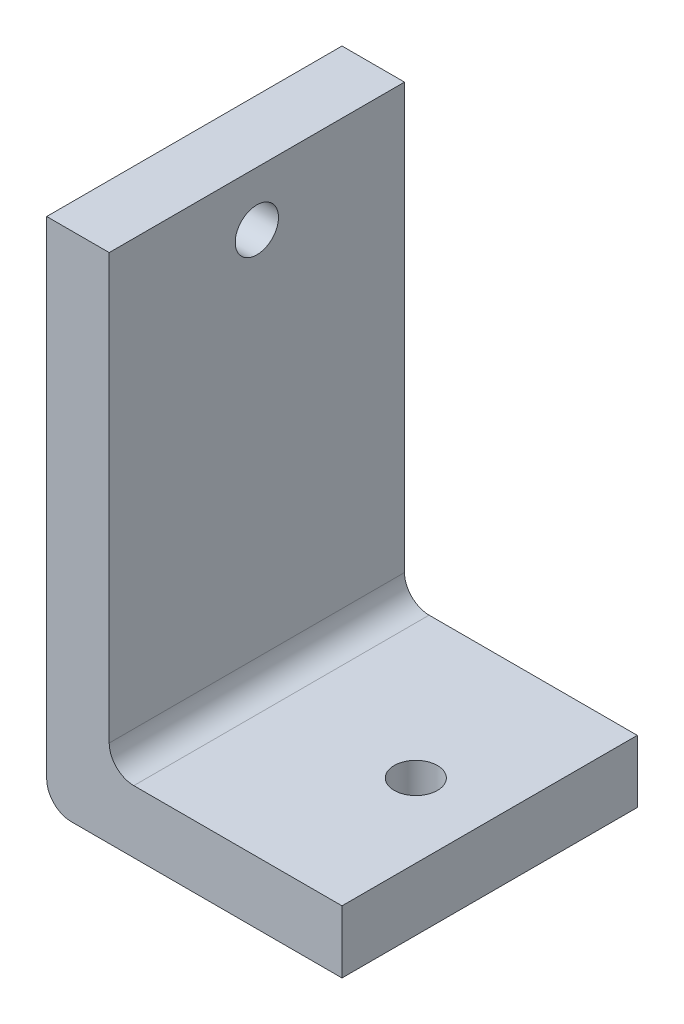
ISO-10303-21;
HEADER;
FILE_DESCRIPTION(('STEP AP214'),'2;1');
FILE_NAME('part.step','',(''),(''),'','','');
FILE_SCHEMA(('AUTOMOTIVE_DESIGN { 1 0 10303 214 1 1 1 1 }'));
ENDSEC;
DATA;
#1=APPLICATION_CONTEXT('core data for automotive mechanical design processes');
#2=APPLICATION_PROTOCOL_DEFINITION('international standard','automotive_design',2000,#1);
#3=PRODUCT_CONTEXT('',#1,'mechanical');
#4=PRODUCT('Part','Part','',(#3));
#5=PRODUCT_RELATED_PRODUCT_CATEGORY('part','',(#4));
#6=PRODUCT_DEFINITION_FORMATION('','',#4);
#7=PRODUCT_DEFINITION_CONTEXT('part definition',#1,'design');
#8=PRODUCT_DEFINITION('design','',#6,#7);
#9=PRODUCT_DEFINITION_SHAPE('','',#8);
#10=(LENGTH_UNIT() NAMED_UNIT(*) SI_UNIT(.MILLI.,.METRE.));
#11=(NAMED_UNIT(*) PLANE_ANGLE_UNIT() SI_UNIT($,.RADIAN.));
#12=(NAMED_UNIT(*) SI_UNIT($,.STERADIAN.) SOLID_ANGLE_UNIT());
#13=UNCERTAINTY_MEASURE_WITH_UNIT(LENGTH_MEASURE(1.E-05),#10,'distance_accuracy_value','');
#14=(GEOMETRIC_REPRESENTATION_CONTEXT(3) GLOBAL_UNCERTAINTY_ASSIGNED_CONTEXT((#13)) GLOBAL_UNIT_ASSIGNED_CONTEXT((#10,
#11,#12)) REPRESENTATION_CONTEXT('',''));
#15=CARTESIAN_POINT('',(0.,0.,0.));
#16=DIRECTION('',(0.,0.,1.));
#17=DIRECTION('',(1.,0.,0.));
#18=AXIS2_PLACEMENT_3D('',#15,#16,#17);
#19=CARTESIAN_POINT('',(6.35,0.,-240.));
#20=DIRECTION('',(1.,0.,0.));
#21=DIRECTION('',(0.,0.,-1.));
#22=AXIS2_PLACEMENT_3D('',#19,#20,#21);
#23=PLANE('',#22);
#24=CARTESIAN_POINT('',(6.35,46.5,-225.));
#25=DIRECTION('',(1.,0.,0.));
#26=DIRECTION('',(0.,0.,-1.));
#27=AXIS2_PLACEMENT_3D('',#24,#25,#26);
#28=CIRCLE('',#27,2.19709999999999);
#29=CARTESIAN_POINT('',(6.35,46.5,-227.1971));
#30=VERTEX_POINT('',#29);
#31=EDGE_CURVE('E124',#30,#30,#28,.T.);
#32=ORIENTED_EDGE('',*,*,#31,.F.);
#33=EDGE_LOOP('',(#32));
#34=FACE_BOUND('',#33,.T.);
#35=DIRECTION('',(0.,1.,0.));
#36=VECTOR('',#35,1.);
#37=CARTESIAN_POINT('',(6.35,67.,-210.));
#38=LINE('',#37,#36);
#39=CARTESIAN_POINT('',(6.35,8.85,-210.));
#40=VERTEX_POINT('',#39);
#41=CARTESIAN_POINT('',(6.35,52.,-210.));
#42=VERTEX_POINT('',#41);
#43=EDGE_CURVE('E169',#40,#42,#38,.T.);
#44=ORIENTED_EDGE('',*,*,#43,.F.);
#45=DIRECTION('',(0.,0.,1.));
#46=VECTOR('',#45,1.);
#47=CARTESIAN_POINT('',(6.35,8.85,-240.));
#48=LINE('',#47,#46);
#49=CARTESIAN_POINT('',(6.35,8.85,-240.));
#50=VERTEX_POINT('',#49);
#51=EDGE_CURVE('E69',#40,#50,#48,.F.);
#52=ORIENTED_EDGE('',*,*,#51,.T.);
#53=DIRECTION('',(0.,1.,0.));
#54=VECTOR('',#53,1.);
#55=CARTESIAN_POINT('',(6.35,0.,-240.));
#56=LINE('',#55,#54);
#57=CARTESIAN_POINT('',(6.35,52.,-240.));
#58=VERTEX_POINT('',#57);
#59=EDGE_CURVE('E141',#50,#58,#56,.T.);
#60=ORIENTED_EDGE('',*,*,#59,.T.);
#61=DIRECTION('',(0.,0.,-1.));
#62=VECTOR('',#61,1.);
#63=CARTESIAN_POINT('',(6.35,52.,5.));
#64=LINE('',#63,#62);
#65=EDGE_CURVE('E174',#42,#58,#64,.T.);
#66=ORIENTED_EDGE('',*,*,#65,.F.);
#67=EDGE_LOOP('',(#44,#52,#60,#66));
#68=FACE_BOUND('',#67,.T.);
#69=ADVANCED_FACE('F48',(#34,#68),#23,.T.);
#70=CARTESIAN_POINT('',(0.,6.35,-240.));
#71=DIRECTION('',(0.,1.,0.));
#72=DIRECTION('',(0.,0.,1.));
#73=AXIS2_PLACEMENT_3D('',#70,#71,#72);
#74=PLANE('',#73);
#75=CARTESIAN_POINT('',(22.5,6.35,-225.));
#76=DIRECTION('',(0.,1.,0.));
#77=DIRECTION('',(0.,0.,1.));
#78=AXIS2_PLACEMENT_3D('',#75,#76,#77);
#79=CIRCLE('',#78,2.19709999999999);
#80=CARTESIAN_POINT('',(22.5,6.35,-222.8029));
#81=VERTEX_POINT('',#80);
#82=EDGE_CURVE('E238',#81,#81,#79,.T.);
#83=ORIENTED_EDGE('',*,*,#82,.F.);
#84=EDGE_LOOP('',(#83));
#85=FACE_BOUND('',#84,.T.);
#86=DIRECTION('',(1.,0.,0.));
#87=VECTOR('',#86,1.);
#88=CARTESIAN_POINT('',(0.,6.35,-240.));
#89=LINE('',#88,#87);
#90=CARTESIAN_POINT('',(30.,6.35,-240.));
#91=VERTEX_POINT('',#90);
#92=CARTESIAN_POINT('',(8.85,6.35,-240.));
#93=VERTEX_POINT('',#92);
#94=EDGE_CURVE('E152',#91,#93,#89,.F.);
#95=ORIENTED_EDGE('',*,*,#94,.T.);
#96=DIRECTION('',(0.,0.,1.));
#97=VECTOR('',#96,1.);
#98=CARTESIAN_POINT('',(8.85,6.35,-210.));
#99=LINE('',#98,#97);
#100=CARTESIAN_POINT('',(8.85,6.35,-210.));
#101=VERTEX_POINT('',#100);
#102=EDGE_CURVE('E165',#93,#101,#99,.T.);
#103=ORIENTED_EDGE('',*,*,#102,.T.);
#104=DIRECTION('',(1.,0.,0.));
#105=VECTOR('',#104,1.);
#106=CARTESIAN_POINT('',(0.,6.35,-210.));
#107=LINE('',#106,#105);
#108=CARTESIAN_POINT('',(30.,6.35,-210.));
#109=VERTEX_POINT('',#108);
#110=EDGE_CURVE('E125',#101,#109,#107,.T.);
#111=ORIENTED_EDGE('',*,*,#110,.T.);
#112=DIRECTION('',(0.,0.,1.));
#113=VECTOR('',#112,1.);
#114=CARTESIAN_POINT('',(30.,6.35,-245.));
#115=LINE('',#114,#113);
#116=EDGE_CURVE('E132',#91,#109,#115,.T.);
#117=ORIENTED_EDGE('',*,*,#116,.F.);
#118=EDGE_LOOP('',(#95,#103,#111,#117));
#119=FACE_BOUND('',#118,.T.);
#120=ADVANCED_FACE('F179',(#85,#119),#74,.T.);
#121=CARTESIAN_POINT('',(0.,0.,-240.));
#122=DIRECTION('',(0.,1.,0.));
#123=DIRECTION('',(0.,0.,1.));
#124=AXIS2_PLACEMENT_3D('',#121,#122,#123);
#125=PLANE('',#124);
#126=CARTESIAN_POINT('',(22.5,0.,-225.));
#127=DIRECTION('',(0.,1.,0.));
#128=DIRECTION('',(0.,0.,1.));
#129=AXIS2_PLACEMENT_3D('',#126,#127,#128);
#130=CIRCLE('',#129,2.1971);
#131=CARTESIAN_POINT('',(22.5,0.,-222.8029));
#132=VERTEX_POINT('',#131);
#133=EDGE_CURVE('E133',#132,#132,#130,.T.);
#134=ORIENTED_EDGE('',*,*,#133,.T.);
#135=EDGE_LOOP('',(#134));
#136=FACE_BOUND('',#135,.T.);
#137=DIRECTION('',(1.,0.,0.));
#138=VECTOR('',#137,1.);
#139=CARTESIAN_POINT('',(0.,0.,-210.));
#140=LINE('',#139,#138);
#141=CARTESIAN_POINT('',(2.5,0.,-210.));
#142=VERTEX_POINT('',#141);
#143=CARTESIAN_POINT('',(30.,0.,-210.));
#144=VERTEX_POINT('',#143);
#145=EDGE_CURVE('E113',#142,#144,#140,.T.);
#146=ORIENTED_EDGE('',*,*,#145,.F.);
#147=DIRECTION('',(0.,0.,1.));
#148=VECTOR('',#147,1.);
#149=CARTESIAN_POINT('',(2.5,0.,-240.));
#150=LINE('',#149,#148);
#151=CARTESIAN_POINT('',(2.5,0.,-240.));
#152=VERTEX_POINT('',#151);
#153=EDGE_CURVE('E161',#142,#152,#150,.F.);
#154=ORIENTED_EDGE('',*,*,#153,.T.);
#155=DIRECTION('',(-1.,0.,0.));
#156=VECTOR('',#155,1.);
#157=CARTESIAN_POINT('',(0.,0.,-240.));
#158=LINE('',#157,#156);
#159=CARTESIAN_POINT('',(30.,0.,-240.));
#160=VERTEX_POINT('',#159);
#161=EDGE_CURVE('E138',#160,#152,#158,.T.);
#162=ORIENTED_EDGE('',*,*,#161,.F.);
#163=DIRECTION('',(0.,0.,1.));
#164=VECTOR('',#163,1.);
#165=CARTESIAN_POINT('',(30.,0.,-245.));
#166=LINE('',#165,#164);
#167=EDGE_CURVE('E129',#160,#144,#166,.T.);
#168=ORIENTED_EDGE('',*,*,#167,.T.);
#169=EDGE_LOOP('',(#146,#154,#162,#168));
#170=FACE_BOUND('',#169,.T.);
#171=ADVANCED_FACE('F136',(#136,#170),#125,.F.);
#172=CARTESIAN_POINT('',(0.,0.,-240.));
#173=DIRECTION('',(1.,0.,0.));
#174=DIRECTION('',(0.,0.,-1.));
#175=AXIS2_PLACEMENT_3D('',#172,#173,#174);
#176=PLANE('',#175);
#177=CARTESIAN_POINT('',(0.,46.5,-225.));
#178=DIRECTION('',(1.,0.,0.));
#179=DIRECTION('',(0.,0.,-1.));
#180=AXIS2_PLACEMENT_3D('',#177,#178,#179);
#181=CIRCLE('',#180,2.1971);
#182=CARTESIAN_POINT('',(0.,46.5,-227.1971));
#183=VERTEX_POINT('',#182);
#184=EDGE_CURVE('E176',#183,#183,#181,.T.);
#185=ORIENTED_EDGE('',*,*,#184,.T.);
#186=EDGE_LOOP('',(#185));
#187=FACE_BOUND('',#186,.T.);
#188=DIRECTION('',(0.,1.,0.));
#189=VECTOR('',#188,1.);
#190=CARTESIAN_POINT('',(0.,0.,-240.));
#191=LINE('',#190,#189);
#192=CARTESIAN_POINT('',(0.,2.5,-240.));
#193=VERTEX_POINT('',#192);
#194=CARTESIAN_POINT('',(0.,52.,-240.));
#195=VERTEX_POINT('',#194);
#196=EDGE_CURVE('E149',#193,#195,#191,.T.);
#197=ORIENTED_EDGE('',*,*,#196,.F.);
#198=DIRECTION('',(0.,0.,1.));
#199=VECTOR('',#198,1.);
#200=CARTESIAN_POINT('',(0.,2.5,-240.));
#201=LINE('',#200,#199);
#202=CARTESIAN_POINT('',(0.,2.5,-210.));
#203=VERTEX_POINT('',#202);
#204=EDGE_CURVE('E157',#193,#203,#201,.T.);
#205=ORIENTED_EDGE('',*,*,#204,.T.);
#206=DIRECTION('',(0.,1.,0.));
#207=VECTOR('',#206,1.);
#208=CARTESIAN_POINT('',(0.,67.,-210.));
#209=LINE('',#208,#207);
#210=CARTESIAN_POINT('',(0.,52.,-210.));
#211=VERTEX_POINT('',#210);
#212=EDGE_CURVE('E175',#203,#211,#209,.T.);
#213=ORIENTED_EDGE('',*,*,#212,.T.);
#214=DIRECTION('',(0.,0.,-1.));
#215=VECTOR('',#214,1.);
#216=CARTESIAN_POINT('',(0.,52.,5.));
#217=LINE('',#216,#215);
#218=EDGE_CURVE('E191',#211,#195,#217,.T.);
#219=ORIENTED_EDGE('',*,*,#218,.T.);
#220=EDGE_LOOP('',(#197,#205,#213,#219));
#221=FACE_BOUND('',#220,.T.);
#222=ADVANCED_FACE('F187',(#187,#221),#176,.F.);
#223=CARTESIAN_POINT('',(30.,0.,-245.));
#224=DIRECTION('',(-1.,0.,0.));
#225=DIRECTION('',(0.,0.,1.));
#226=AXIS2_PLACEMENT_3D('',#223,#224,#225);
#227=PLANE('',#226);
#228=DIRECTION('',(0.,1.,0.));
#229=VECTOR('',#228,1.);
#230=CARTESIAN_POINT('',(30.,62.,-210.));
#231=LINE('',#230,#229);
#232=EDGE_CURVE('E118',#144,#109,#231,.T.);
#233=ORIENTED_EDGE('',*,*,#232,.F.);
#234=ORIENTED_EDGE('',*,*,#167,.F.);
#235=DIRECTION('',(0.,1.,0.));
#236=VECTOR('',#235,1.);
#237=CARTESIAN_POINT('',(30.,55.,-240.));
#238=LINE('',#237,#236);
#239=EDGE_CURVE('E139',#160,#91,#238,.T.);
#240=ORIENTED_EDGE('',*,*,#239,.T.);
#241=ORIENTED_EDGE('',*,*,#116,.T.);
#242=EDGE_LOOP('',(#233,#234,#240,#241));
#243=FACE_BOUND('',#242,.T.);
#244=ADVANCED_FACE('F128',(#243),#227,.F.);
#245=CARTESIAN_POINT('',(6.35,55.,-240.));
#246=DIRECTION('',(0.,0.,-1.));
#247=DIRECTION('',(-1.,0.,0.));
#248=AXIS2_PLACEMENT_3D('',#245,#246,#247);
#249=PLANE('',#248);
#250=ORIENTED_EDGE('',*,*,#161,.T.);
#251=CARTESIAN_POINT('',(2.5,2.5,-240.));
#252=DIRECTION('',(0.,0.,-1.));
#253=DIRECTION('',(-1.,0.,0.));
#254=AXIS2_PLACEMENT_3D('',#251,#252,#253);
#255=CIRCLE('',#254,2.5);
#256=EDGE_CURVE('E163',#152,#193,#255,.T.);
#257=ORIENTED_EDGE('',*,*,#256,.T.);
#258=ORIENTED_EDGE('',*,*,#196,.T.);
#259=DIRECTION('',(-1.,0.,0.));
#260=VECTOR('',#259,1.);
#261=CARTESIAN_POINT('',(6.35,52.,-240.));
#262=LINE('',#261,#260);
#263=EDGE_CURVE('E143',#58,#195,#262,.T.);
#264=ORIENTED_EDGE('',*,*,#263,.F.);
#265=ORIENTED_EDGE('',*,*,#59,.F.);
#266=CARTESIAN_POINT('',(8.85,8.85,-240.));
#267=DIRECTION('',(0.,0.,-1.));
#268=DIRECTION('',(-1.,0.,0.));
#269=AXIS2_PLACEMENT_3D('',#266,#267,#268);
#270=CIRCLE('',#269,2.5);
#271=EDGE_CURVE('E13',#50,#93,#270,.F.);
#272=ORIENTED_EDGE('',*,*,#271,.T.);
#273=ORIENTED_EDGE('',*,*,#94,.F.);
#274=ORIENTED_EDGE('',*,*,#239,.F.);
#275=EDGE_LOOP('',(#250,#257,#258,#264,#265,#272,#273,#274));
#276=FACE_BOUND('',#275,.T.);
#277=ADVANCED_FACE('F180',(#276),#249,.T.);
#278=CARTESIAN_POINT('',(0.,52.,5.));
#279=DIRECTION('',(0.,-1.,0.));
#280=DIRECTION('',(0.,0.,-1.));
#281=AXIS2_PLACEMENT_3D('',#278,#279,#280);
#282=PLANE('',#281);
#283=ORIENTED_EDGE('',*,*,#218,.F.);
#284=DIRECTION('',(1.,0.,0.));
#285=VECTOR('',#284,1.);
#286=CARTESIAN_POINT('',(0.,52.,-210.));
#287=LINE('',#286,#285);
#288=EDGE_CURVE('E154',#211,#42,#287,.T.);
#289=ORIENTED_EDGE('',*,*,#288,.T.);
#290=ORIENTED_EDGE('',*,*,#65,.T.);
#291=ORIENTED_EDGE('',*,*,#263,.T.);
#292=EDGE_LOOP('',(#283,#289,#290,#291));
#293=FACE_BOUND('',#292,.T.);
#294=ADVANCED_FACE('F198',(#293),#282,.F.);
#295=CARTESIAN_POINT('',(0.,67.,-210.));
#296=DIRECTION('',(0.,0.,-1.));
#297=DIRECTION('',(-1.,0.,0.));
#298=AXIS2_PLACEMENT_3D('',#295,#296,#297);
#299=PLANE('',#298);
#300=ORIENTED_EDGE('',*,*,#212,.F.);
#301=CARTESIAN_POINT('',(2.5,2.5,-210.));
#302=DIRECTION('',(0.,0.,-1.));
#303=DIRECTION('',(-1.,0.,0.));
#304=AXIS2_PLACEMENT_3D('',#301,#302,#303);
#305=CIRCLE('',#304,2.5);
#306=EDGE_CURVE('E120',#203,#142,#305,.F.);
#307=ORIENTED_EDGE('',*,*,#306,.T.);
#308=ORIENTED_EDGE('',*,*,#145,.T.);
#309=ORIENTED_EDGE('',*,*,#232,.T.);
#310=ORIENTED_EDGE('',*,*,#110,.F.);
#311=CARTESIAN_POINT('',(8.85,8.85,-210.));
#312=DIRECTION('',(0.,0.,-1.));
#313=DIRECTION('',(-1.,0.,0.));
#314=AXIS2_PLACEMENT_3D('',#311,#312,#313);
#315=CIRCLE('',#314,2.5);
#316=EDGE_CURVE('E56',#101,#40,#315,.T.);
#317=ORIENTED_EDGE('',*,*,#316,.T.);
#318=ORIENTED_EDGE('',*,*,#43,.T.);
#319=ORIENTED_EDGE('',*,*,#288,.F.);
#320=EDGE_LOOP('',(#300,#307,#308,#309,#310,#317,#318,#319));
#321=FACE_BOUND('',#320,.T.);
#322=ADVANCED_FACE('F116',(#321),#299,.F.);
#323=CARTESIAN_POINT('',(6.35,46.5,-225.));
#324=DIRECTION('',(1.,0.,0.));
#325=DIRECTION('',(0.,0.,-1.));
#326=AXIS2_PLACEMENT_3D('',#323,#324,#325);
#327=CYLINDRICAL_SURFACE('',#326,2.19709999999999);
#328=ORIENTED_EDGE('',*,*,#184,.F.);
#329=EDGE_LOOP('',(#328));
#330=FACE_BOUND('',#329,.T.);
#331=ORIENTED_EDGE('',*,*,#31,.T.);
#332=EDGE_LOOP('',(#331));
#333=FACE_BOUND('',#332,.T.);
#334=ADVANCED_FACE('F205',(#330,#333),#327,.F.);
#335=CARTESIAN_POINT('',(22.5,6.35,-225.));
#336=DIRECTION('',(0.,1.,0.));
#337=DIRECTION('',(0.,0.,1.));
#338=AXIS2_PLACEMENT_3D('',#335,#336,#337);
#339=CYLINDRICAL_SURFACE('',#338,2.19709999999999);
#340=ORIENTED_EDGE('',*,*,#133,.F.);
#341=EDGE_LOOP('',(#340));
#342=FACE_BOUND('',#341,.T.);
#343=ORIENTED_EDGE('',*,*,#82,.T.);
#344=EDGE_LOOP('',(#343));
#345=FACE_BOUND('',#344,.T.);
#346=ADVANCED_FACE('F221',(#342,#345),#339,.F.);
#347=CARTESIAN_POINT('',(2.5,2.5,-240.));
#348=DIRECTION('',(0.,0.,1.));
#349=DIRECTION('',(1.,0.,0.));
#350=AXIS2_PLACEMENT_3D('',#347,#348,#349);
#351=CYLINDRICAL_SURFACE('',#350,2.5);
#352=ORIENTED_EDGE('',*,*,#256,.F.);
#353=ORIENTED_EDGE('',*,*,#153,.F.);
#354=ORIENTED_EDGE('',*,*,#306,.F.);
#355=ORIENTED_EDGE('',*,*,#204,.F.);
#356=EDGE_LOOP('',(#352,#353,#354,#355));
#357=FACE_BOUND('',#356,.T.);
#358=ADVANCED_FACE('F185',(#357),#351,.T.);
#359=CARTESIAN_POINT('',(8.85,8.85,-240.));
#360=DIRECTION('',(0.,0.,-1.));
#361=DIRECTION('',(-1.,0.,0.));
#362=AXIS2_PLACEMENT_3D('',#359,#360,#361);
#363=CYLINDRICAL_SURFACE('',#362,2.5);
#364=ORIENTED_EDGE('',*,*,#271,.F.);
#365=ORIENTED_EDGE('',*,*,#51,.F.);
#366=ORIENTED_EDGE('',*,*,#316,.F.);
#367=ORIENTED_EDGE('',*,*,#102,.F.);
#368=EDGE_LOOP('',(#364,#365,#366,#367));
#369=FACE_BOUND('',#368,.T.);
#370=ADVANCED_FACE('F50',(#369),#363,.F.);
#371=CLOSED_SHELL('',(#69,#120,#171,#222,#244,#277,#294,#322,#334,#346,#358,#370));
#372=MANIFOLD_SOLID_BREP('B2',#371);
#373=ADVANCED_BREP_SHAPE_REPRESENTATION('',(#18,#372),#14);
#374=SHAPE_DEFINITION_REPRESENTATION(#9,#373);
ENDSEC;
END-ISO-10303-21;
